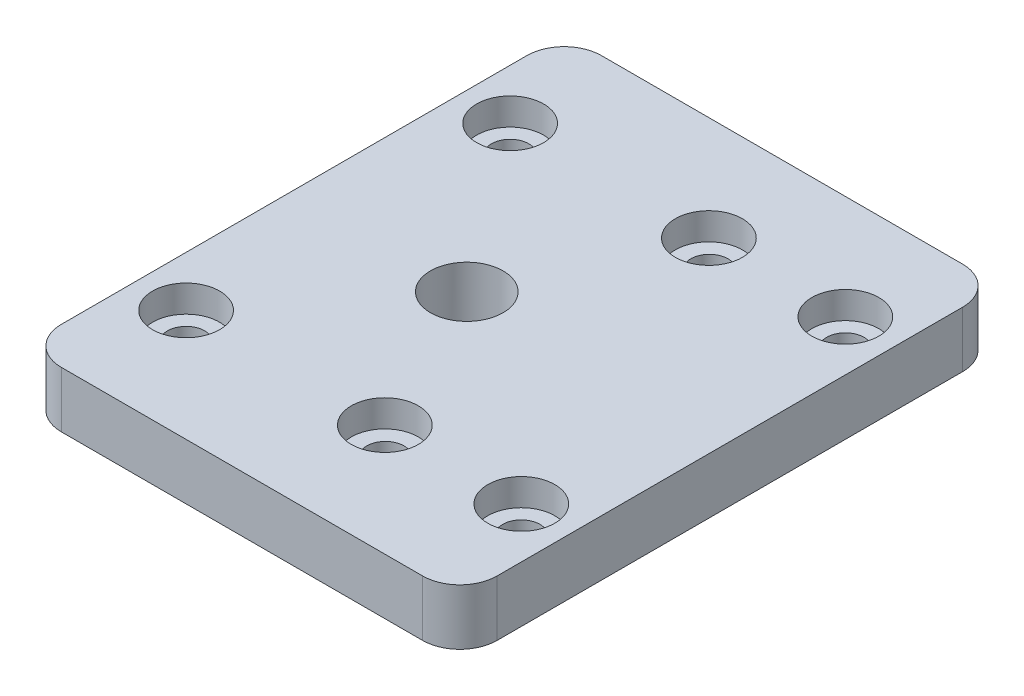
ISO-10303-21;
HEADER;
FILE_DESCRIPTION(('STEP AP214'),'2;1');
FILE_NAME('part.step','',(''),(''),'','','');
FILE_SCHEMA(('AUTOMOTIVE_DESIGN { 1 0 10303 214 1 1 1 1 }'));
ENDSEC;
DATA;
#1=APPLICATION_CONTEXT('core data for automotive mechanical design processes');
#2=APPLICATION_PROTOCOL_DEFINITION('international standard','automotive_design',2000,#1);
#3=PRODUCT_CONTEXT('',#1,'mechanical');
#4=PRODUCT('Part','Part','',(#3));
#5=PRODUCT_RELATED_PRODUCT_CATEGORY('part','',(#4));
#6=PRODUCT_DEFINITION_FORMATION('','',#4);
#7=PRODUCT_DEFINITION_CONTEXT('part definition',#1,'design');
#8=PRODUCT_DEFINITION('design','',#6,#7);
#9=PRODUCT_DEFINITION_SHAPE('','',#8);
#10=(LENGTH_UNIT() NAMED_UNIT(*) SI_UNIT(.MILLI.,.METRE.));
#11=(NAMED_UNIT(*) PLANE_ANGLE_UNIT() SI_UNIT($,.RADIAN.));
#12=(NAMED_UNIT(*) SI_UNIT($,.STERADIAN.) SOLID_ANGLE_UNIT());
#13=UNCERTAINTY_MEASURE_WITH_UNIT(LENGTH_MEASURE(1.E-05),#10,'distance_accuracy_value','');
#14=(GEOMETRIC_REPRESENTATION_CONTEXT(3) GLOBAL_UNCERTAINTY_ASSIGNED_CONTEXT((#13)) GLOBAL_UNIT_ASSIGNED_CONTEXT((#10,
#11,#12)) REPRESENTATION_CONTEXT('',''));
#15=CARTESIAN_POINT('',(0.,0.,0.));
#16=DIRECTION('',(0.,0.,1.));
#17=DIRECTION('',(1.,0.,0.));
#18=AXIS2_PLACEMENT_3D('',#15,#16,#17);
#19=CARTESIAN_POINT('',(-9.,-7.,-8.9));
#20=DIRECTION('',(0.,1.,0.));
#21=DIRECTION('',(0.,0.,1.));
#22=AXIS2_PLACEMENT_3D('',#19,#20,#21);
#23=CYLINDRICAL_SURFACE('',#22,1.);
#24=CARTESIAN_POINT('',(-9.,0.,-8.9));
#25=DIRECTION('',(0.,-1.,0.));
#26=DIRECTION('',(0.,0.,-1.));
#27=AXIS2_PLACEMENT_3D('',#24,#25,#26);
#28=CIRCLE('',#27,1.);
#29=CARTESIAN_POINT('',(-9.,0.,-9.9));
#30=VERTEX_POINT('',#29);
#31=EDGE_CURVE('E169',#30,#30,#28,.T.);
#32=ORIENTED_EDGE('',*,*,#31,.T.);
#33=EDGE_LOOP('',(#32));
#34=FACE_BOUND('',#33,.T.);
#35=CARTESIAN_POINT('',(-9.,1.55,-8.9));
#36=DIRECTION('',(0.,1.,0.));
#37=DIRECTION('',(0.,0.,1.));
#38=AXIS2_PLACEMENT_3D('',#35,#36,#37);
#39=CIRCLE('',#38,1.);
#40=CARTESIAN_POINT('',(-9.,1.55,-7.9));
#41=VERTEX_POINT('',#40);
#42=EDGE_CURVE('E40',#41,#41,#39,.F.);
#43=ORIENTED_EDGE('',*,*,#42,.F.);
#44=EDGE_LOOP('',(#43));
#45=FACE_BOUND('',#44,.T.);
#46=ADVANCED_FACE('F36',(#34,#45),#23,.F.);
#47=CARTESIAN_POINT('',(1.7,-7.,-8.9));
#48=DIRECTION('',(0.,1.,0.));
#49=DIRECTION('',(0.,0.,1.));
#50=AXIS2_PLACEMENT_3D('',#47,#48,#49);
#51=CYLINDRICAL_SURFACE('',#50,1.);
#52=CARTESIAN_POINT('',(1.7,0.,-8.9));
#53=DIRECTION('',(0.,-1.,0.));
#54=DIRECTION('',(0.,0.,-1.));
#55=AXIS2_PLACEMENT_3D('',#52,#53,#54);
#56=CIRCLE('',#55,1.);
#57=CARTESIAN_POINT('',(1.7,0.,-9.9));
#58=VERTEX_POINT('',#57);
#59=EDGE_CURVE('E165',#58,#58,#56,.T.);
#60=ORIENTED_EDGE('',*,*,#59,.T.);
#61=EDGE_LOOP('',(#60));
#62=FACE_BOUND('',#61,.T.);
#63=CARTESIAN_POINT('',(1.7,1.55,-8.9));
#64=DIRECTION('',(0.,1.,0.));
#65=DIRECTION('',(0.,0.,1.));
#66=AXIS2_PLACEMENT_3D('',#63,#64,#65);
#67=CIRCLE('',#66,1.);
#68=CARTESIAN_POINT('',(1.7,1.55,-7.9));
#69=VERTEX_POINT('',#68);
#70=EDGE_CURVE('E194',#69,#69,#67,.F.);
#71=ORIENTED_EDGE('',*,*,#70,.F.);
#72=EDGE_LOOP('',(#71));
#73=FACE_BOUND('',#72,.T.);
#74=ADVANCED_FACE('F273',(#62,#73),#51,.F.);
#75=CARTESIAN_POINT('',(9.,3.,-8.9));
#76=DIRECTION('',(0.,-1.,0.));
#77=DIRECTION('',(0.,0.,-1.));
#78=AXIS2_PLACEMENT_3D('',#75,#76,#77);
#79=CYLINDRICAL_SURFACE('',#78,1.);
#80=CARTESIAN_POINT('',(9.,0.,-8.9));
#81=DIRECTION('',(0.,1.,0.));
#82=DIRECTION('',(0.,0.,1.));
#83=AXIS2_PLACEMENT_3D('',#80,#81,#82);
#84=CIRCLE('',#83,1.);
#85=CARTESIAN_POINT('',(9.,0.,-7.9));
#86=VERTEX_POINT('',#85);
#87=EDGE_CURVE('E231',#86,#86,#84,.T.);
#88=ORIENTED_EDGE('',*,*,#87,.F.);
#89=EDGE_LOOP('',(#88));
#90=FACE_BOUND('',#89,.T.);
#91=CARTESIAN_POINT('',(9.,1.55,-8.9));
#92=DIRECTION('',(0.,1.,0.));
#93=DIRECTION('',(0.,0.,1.));
#94=AXIS2_PLACEMENT_3D('',#91,#92,#93);
#95=CIRCLE('',#94,1.);
#96=CARTESIAN_POINT('',(9.,1.55,-7.9));
#97=VERTEX_POINT('',#96);
#98=EDGE_CURVE('E190',#97,#97,#95,.T.);
#99=ORIENTED_EDGE('',*,*,#98,.T.);
#100=EDGE_LOOP('',(#99));
#101=FACE_BOUND('',#100,.T.);
#102=ADVANCED_FACE('F279',(#90,#101),#79,.F.);
#103=CARTESIAN_POINT('',(9.,3.,8.5));
#104=DIRECTION('',(0.,-1.,0.));
#105=DIRECTION('',(0.,0.,-1.));
#106=AXIS2_PLACEMENT_3D('',#103,#104,#105);
#107=CYLINDRICAL_SURFACE('',#106,1.);
#108=CARTESIAN_POINT('',(9.,0.,8.5));
#109=DIRECTION('',(0.,1.,0.));
#110=DIRECTION('',(0.,0.,-1.));
#111=AXIS2_PLACEMENT_3D('',#108,#109,#110);
#112=CIRCLE('',#111,1.);
#113=CARTESIAN_POINT('',(9.,0.,7.5));
#114=VERTEX_POINT('',#113);
#115=EDGE_CURVE('E137',#114,#114,#112,.T.);
#116=ORIENTED_EDGE('',*,*,#115,.F.);
#117=EDGE_LOOP('',(#116));
#118=FACE_BOUND('',#117,.T.);
#119=CARTESIAN_POINT('',(9.,1.55,8.5));
#120=DIRECTION('',(0.,1.,0.));
#121=DIRECTION('',(0.,0.,1.));
#122=AXIS2_PLACEMENT_3D('',#119,#120,#121);
#123=CIRCLE('',#122,1.);
#124=CARTESIAN_POINT('',(9.,1.55,9.5));
#125=VERTEX_POINT('',#124);
#126=EDGE_CURVE('E185',#125,#125,#123,.T.);
#127=ORIENTED_EDGE('',*,*,#126,.T.);
#128=EDGE_LOOP('',(#127));
#129=FACE_BOUND('',#128,.T.);
#130=ADVANCED_FACE('F289',(#118,#129),#107,.F.);
#131=CARTESIAN_POINT('',(1.7,3.,8.5));
#132=DIRECTION('',(0.,-1.,0.));
#133=DIRECTION('',(0.,0.,-1.));
#134=AXIS2_PLACEMENT_3D('',#131,#132,#133);
#135=CYLINDRICAL_SURFACE('',#134,1.);
#136=CARTESIAN_POINT('',(1.7,0.,8.5));
#137=DIRECTION('',(0.,1.,0.));
#138=DIRECTION('',(0.,0.,-1.));
#139=AXIS2_PLACEMENT_3D('',#136,#137,#138);
#140=CIRCLE('',#139,1.);
#141=CARTESIAN_POINT('',(1.7,0.,7.5));
#142=VERTEX_POINT('',#141);
#143=EDGE_CURVE('E168',#142,#142,#140,.T.);
#144=ORIENTED_EDGE('',*,*,#143,.F.);
#145=EDGE_LOOP('',(#144));
#146=FACE_BOUND('',#145,.T.);
#147=CARTESIAN_POINT('',(1.7,1.55,8.5));
#148=DIRECTION('',(0.,1.,0.));
#149=DIRECTION('',(0.,0.,1.));
#150=AXIS2_PLACEMENT_3D('',#147,#148,#149);
#151=CIRCLE('',#150,1.);
#152=CARTESIAN_POINT('',(1.7,1.55,9.5));
#153=VERTEX_POINT('',#152);
#154=EDGE_CURVE('E180',#153,#153,#151,.T.);
#155=ORIENTED_EDGE('',*,*,#154,.T.);
#156=EDGE_LOOP('',(#155));
#157=FACE_BOUND('',#156,.T.);
#158=ADVANCED_FACE('F285',(#146,#157),#135,.F.);
#159=CARTESIAN_POINT('',(-9.,3.,8.5));
#160=DIRECTION('',(0.,-1.,0.));
#161=DIRECTION('',(0.,0.,-1.));
#162=AXIS2_PLACEMENT_3D('',#159,#160,#161);
#163=CYLINDRICAL_SURFACE('',#162,1.);
#164=CARTESIAN_POINT('',(-9.,0.,8.5));
#165=DIRECTION('',(0.,1.,0.));
#166=DIRECTION('',(0.,0.,-1.));
#167=AXIS2_PLACEMENT_3D('',#164,#165,#166);
#168=CIRCLE('',#167,1.);
#169=CARTESIAN_POINT('',(-9.,0.,7.5));
#170=VERTEX_POINT('',#169);
#171=EDGE_CURVE('E234',#170,#170,#168,.T.);
#172=ORIENTED_EDGE('',*,*,#171,.F.);
#173=EDGE_LOOP('',(#172));
#174=FACE_BOUND('',#173,.T.);
#175=CARTESIAN_POINT('',(-9.,1.55,8.5));
#176=DIRECTION('',(0.,1.,0.));
#177=DIRECTION('',(0.,0.,1.));
#178=AXIS2_PLACEMENT_3D('',#175,#176,#177);
#179=CIRCLE('',#178,1.);
#180=CARTESIAN_POINT('',(-9.,1.55,9.5));
#181=VERTEX_POINT('',#180);
#182=EDGE_CURVE('E176',#181,#181,#179,.T.);
#183=ORIENTED_EDGE('',*,*,#182,.T.);
#184=EDGE_LOOP('',(#183));
#185=FACE_BOUND('',#184,.T.);
#186=ADVANCED_FACE('F288',(#174,#185),#163,.F.);
#187=CARTESIAN_POINT('',(0.,3.,0.));
#188=DIRECTION('',(0.,-1.,0.));
#189=DIRECTION('',(0.,0.,-1.));
#190=AXIS2_PLACEMENT_3D('',#187,#188,#189);
#191=PLANE('',#190);
#192=CARTESIAN_POINT('',(-9.,3.,-8.9));
#193=DIRECTION('',(0.,1.,0.));
#194=DIRECTION('',(0.,0.,1.));
#195=AXIS2_PLACEMENT_3D('',#192,#193,#194);
#196=CIRCLE('',#195,1.8);
#197=CARTESIAN_POINT('',(-9.,3.,-7.1));
#198=VERTEX_POINT('',#197);
#199=EDGE_CURVE('E210',#198,#198,#196,.T.);
#200=ORIENTED_EDGE('',*,*,#199,.F.);
#201=EDGE_LOOP('',(#200));
#202=FACE_BOUND('',#201,.T.);
#203=CARTESIAN_POINT('',(1.67182258338477,3.,-8.89999999999191));
#204=DIRECTION('',(0.,1.,0.));
#205=DIRECTION('',(0.,0.,1.));
#206=AXIS2_PLACEMENT_3D('',#203,#204,#205);
#207=CIRCLE('',#206,1.80000000000306);
#208=CARTESIAN_POINT('',(1.67182258338477,3.,-7.09999999998885));
#209=VERTEX_POINT('',#208);
#210=EDGE_CURVE('E203',#209,#209,#207,.T.);
#211=ORIENTED_EDGE('',*,*,#210,.F.);
#212=EDGE_LOOP('',(#211));
#213=FACE_BOUND('',#212,.T.);
#214=CARTESIAN_POINT('',(9.,3.,-8.9));
#215=DIRECTION('',(0.,1.,0.));
#216=DIRECTION('',(0.,0.,1.));
#217=AXIS2_PLACEMENT_3D('',#214,#215,#216);
#218=CIRCLE('',#217,1.8);
#219=CARTESIAN_POINT('',(9.,3.,-7.1));
#220=VERTEX_POINT('',#219);
#221=EDGE_CURVE('E196',#220,#220,#218,.T.);
#222=ORIENTED_EDGE('',*,*,#221,.F.);
#223=EDGE_LOOP('',(#222));
#224=FACE_BOUND('',#223,.T.);
#225=CARTESIAN_POINT('',(9.,3.,8.5));
#226=DIRECTION('',(0.,1.,0.));
#227=DIRECTION('',(0.,0.,1.));
#228=AXIS2_PLACEMENT_3D('',#225,#226,#227);
#229=CIRCLE('',#228,1.8);
#230=CARTESIAN_POINT('',(9.,3.,10.3));
#231=VERTEX_POINT('',#230);
#232=EDGE_CURVE('E192',#231,#231,#229,.T.);
#233=ORIENTED_EDGE('',*,*,#232,.F.);
#234=EDGE_LOOP('',(#233));
#235=FACE_BOUND('',#234,.T.);
#236=CARTESIAN_POINT('',(1.67182258337933,3.,8.50000000000803));
#237=DIRECTION('',(0.,1.,0.));
#238=DIRECTION('',(0.,0.,1.));
#239=AXIS2_PLACEMENT_3D('',#236,#237,#238);
#240=CIRCLE('',#239,1.80000000000306);
#241=CARTESIAN_POINT('',(1.67182258337933,3.,10.3000000000111));
#242=VERTEX_POINT('',#241);
#243=EDGE_CURVE('E188',#242,#242,#240,.T.);
#244=ORIENTED_EDGE('',*,*,#243,.F.);
#245=EDGE_LOOP('',(#244));
#246=FACE_BOUND('',#245,.T.);
#247=CARTESIAN_POINT('',(-9.,3.,8.5));
#248=DIRECTION('',(0.,1.,0.));
#249=DIRECTION('',(0.,0.,1.));
#250=AXIS2_PLACEMENT_3D('',#247,#248,#249);
#251=CIRCLE('',#250,1.8);
#252=CARTESIAN_POINT('',(-9.,3.,10.3));
#253=VERTEX_POINT('',#252);
#254=EDGE_CURVE('E183',#253,#253,#251,.T.);
#255=ORIENTED_EDGE('',*,*,#254,.F.);
#256=EDGE_LOOP('',(#255));
#257=FACE_BOUND('',#256,.T.);
#258=CARTESIAN_POINT('',(-2.3281774166205,3.,0.100000000001835));
#259=DIRECTION('',(0.,1.,0.));
#260=DIRECTION('',(0.,0.,1.));
#261=AXIS2_PLACEMENT_3D('',#258,#259,#260);
#262=CIRCLE('',#261,1.95);
#263=CARTESIAN_POINT('',(-2.3281774166205,3.,2.05000000000184));
#264=VERTEX_POINT('',#263);
#265=EDGE_CURVE('E175',#264,#264,#262,.T.);
#266=ORIENTED_EDGE('',*,*,#265,.F.);
#267=EDGE_LOOP('',(#266));
#268=FACE_BOUND('',#267,.T.);
#269=DIRECTION('',(0.,0.,-1.));
#270=VECTOR('',#269,1.);
#271=CARTESIAN_POINT('',(11.7,3.,14.5));
#272=LINE('',#271,#270);
#273=CARTESIAN_POINT('',(11.7,3.,12.5));
#274=VERTEX_POINT('',#273);
#275=CARTESIAN_POINT('',(11.7,3.,-12.5));
#276=VERTEX_POINT('',#275);
#277=EDGE_CURVE('E142',#274,#276,#272,.T.);
#278=ORIENTED_EDGE('',*,*,#277,.T.);
#279=CARTESIAN_POINT('',(9.69999999999999,3.,-12.5));
#280=DIRECTION('',(0.,-1.,0.));
#281=DIRECTION('',(0.,0.,-1.));
#282=AXIS2_PLACEMENT_3D('',#279,#280,#281);
#283=CIRCLE('',#282,2.);
#284=CARTESIAN_POINT('',(9.69999999999999,3.,-14.5));
#285=VERTEX_POINT('',#284);
#286=EDGE_CURVE('E157',#276,#285,#283,.F.);
#287=ORIENTED_EDGE('',*,*,#286,.T.);
#288=DIRECTION('',(-1.,0.,0.));
#289=VECTOR('',#288,1.);
#290=CARTESIAN_POINT('',(-11.7,3.,-14.5));
#291=LINE('',#290,#289);
#292=CARTESIAN_POINT('',(-9.7,3.,-14.5));
#293=VERTEX_POINT('',#292);
#294=EDGE_CURVE('E124',#285,#293,#291,.T.);
#295=ORIENTED_EDGE('',*,*,#294,.T.);
#296=CARTESIAN_POINT('',(-9.7,3.,-12.5));
#297=DIRECTION('',(0.,-1.,0.));
#298=DIRECTION('',(0.,0.,-1.));
#299=AXIS2_PLACEMENT_3D('',#296,#297,#298);
#300=CIRCLE('',#299,2.);
#301=CARTESIAN_POINT('',(-11.7,3.,-12.5));
#302=VERTEX_POINT('',#301);
#303=EDGE_CURVE('E152',#293,#302,#300,.F.);
#304=ORIENTED_EDGE('',*,*,#303,.T.);
#305=DIRECTION('',(0.,0.,1.));
#306=VECTOR('',#305,1.);
#307=CARTESIAN_POINT('',(-11.7,3.,14.5));
#308=LINE('',#307,#306);
#309=CARTESIAN_POINT('',(-11.7,3.,12.5));
#310=VERTEX_POINT('',#309);
#311=EDGE_CURVE('E242',#302,#310,#308,.T.);
#312=ORIENTED_EDGE('',*,*,#311,.T.);
#313=CARTESIAN_POINT('',(-9.7,3.,12.5));
#314=DIRECTION('',(0.,-1.,0.));
#315=DIRECTION('',(0.,0.,-1.));
#316=AXIS2_PLACEMENT_3D('',#313,#314,#315);
#317=CIRCLE('',#316,2.);
#318=CARTESIAN_POINT('',(-9.7,3.,14.5));
#319=VERTEX_POINT('',#318);
#320=EDGE_CURVE('E60',#310,#319,#317,.F.);
#321=ORIENTED_EDGE('',*,*,#320,.T.);
#322=DIRECTION('',(1.,0.,0.));
#323=VECTOR('',#322,1.);
#324=CARTESIAN_POINT('',(-11.7,3.,14.5));
#325=LINE('',#324,#323);
#326=CARTESIAN_POINT('',(9.69999999999999,3.,14.5));
#327=VERTEX_POINT('',#326);
#328=EDGE_CURVE('E143',#319,#327,#325,.T.);
#329=ORIENTED_EDGE('',*,*,#328,.T.);
#330=CARTESIAN_POINT('',(9.7,3.,12.5));
#331=DIRECTION('',(0.,-1.,0.));
#332=DIRECTION('',(0.,0.,-1.));
#333=AXIS2_PLACEMENT_3D('',#330,#331,#332);
#334=CIRCLE('',#333,2.);
#335=EDGE_CURVE('E155',#327,#274,#334,.F.);
#336=ORIENTED_EDGE('',*,*,#335,.T.);
#337=EDGE_LOOP('',(#278,#287,#295,#304,#312,#321,#329,#336));
#338=FACE_BOUND('',#337,.T.);
#339=ADVANCED_FACE('F244',(#202,#213,#224,#235,#246,#257,#268,#338),#191,.F.);
#340=CARTESIAN_POINT('',(0.,0.,0.));
#341=DIRECTION('',(0.,-1.,0.));
#342=DIRECTION('',(0.,0.,-1.));
#343=AXIS2_PLACEMENT_3D('',#340,#341,#342);
#344=PLANE('',#343);
#345=CARTESIAN_POINT('',(-2.3281774166205,0.,0.100000000001835));
#346=DIRECTION('',(0.,-1.,0.));
#347=DIRECTION('',(0.,0.,-1.));
#348=AXIS2_PLACEMENT_3D('',#345,#346,#347);
#349=CIRCLE('',#348,1.95);
#350=CARTESIAN_POINT('',(-2.3281774166205,0.,-1.84999999999817));
#351=VERTEX_POINT('',#350);
#352=EDGE_CURVE('E172',#351,#351,#349,.T.);
#353=ORIENTED_EDGE('',*,*,#352,.F.);
#354=EDGE_LOOP('',(#353));
#355=FACE_BOUND('',#354,.T.);
#356=ORIENTED_EDGE('',*,*,#31,.F.);
#357=EDGE_LOOP('',(#356));
#358=FACE_BOUND('',#357,.T.);
#359=ORIENTED_EDGE('',*,*,#59,.F.);
#360=EDGE_LOOP('',(#359));
#361=FACE_BOUND('',#360,.T.);
#362=ORIENTED_EDGE('',*,*,#87,.T.);
#363=EDGE_LOOP('',(#362));
#364=FACE_BOUND('',#363,.T.);
#365=ORIENTED_EDGE('',*,*,#115,.T.);
#366=EDGE_LOOP('',(#365));
#367=FACE_BOUND('',#366,.T.);
#368=DIRECTION('',(-1.,0.,0.));
#369=VECTOR('',#368,1.);
#370=CARTESIAN_POINT('',(-11.7,0.,-14.5));
#371=LINE('',#370,#369);
#372=CARTESIAN_POINT('',(9.69999999999999,0.,-14.5));
#373=VERTEX_POINT('',#372);
#374=CARTESIAN_POINT('',(-9.7,0.,-14.5));
#375=VERTEX_POINT('',#374);
#376=EDGE_CURVE('E121',#373,#375,#371,.T.);
#377=ORIENTED_EDGE('',*,*,#376,.F.);
#378=CARTESIAN_POINT('',(9.69999999999999,0.,-12.5));
#379=DIRECTION('',(0.,-1.,0.));
#380=DIRECTION('',(0.,0.,-1.));
#381=AXIS2_PLACEMENT_3D('',#378,#379,#380);
#382=CIRCLE('',#381,2.);
#383=CARTESIAN_POINT('',(11.7,0.,-12.5));
#384=VERTEX_POINT('',#383);
#385=EDGE_CURVE('E104',#373,#384,#382,.T.);
#386=ORIENTED_EDGE('',*,*,#385,.T.);
#387=DIRECTION('',(0.,0.,-1.));
#388=VECTOR('',#387,1.);
#389=CARTESIAN_POINT('',(11.7,0.,14.5));
#390=LINE('',#389,#388);
#391=CARTESIAN_POINT('',(11.7,0.,12.5));
#392=VERTEX_POINT('',#391);
#393=EDGE_CURVE('E132',#392,#384,#390,.T.);
#394=ORIENTED_EDGE('',*,*,#393,.F.);
#395=CARTESIAN_POINT('',(9.7,0.,12.5));
#396=DIRECTION('',(0.,-1.,0.));
#397=DIRECTION('',(0.,0.,-1.));
#398=AXIS2_PLACEMENT_3D('',#395,#396,#397);
#399=CIRCLE('',#398,2.);
#400=CARTESIAN_POINT('',(9.69999999999999,0.,14.5));
#401=VERTEX_POINT('',#400);
#402=EDGE_CURVE('E115',#392,#401,#399,.T.);
#403=ORIENTED_EDGE('',*,*,#402,.T.);
#404=DIRECTION('',(1.,0.,0.));
#405=VECTOR('',#404,1.);
#406=CARTESIAN_POINT('',(-11.7,0.,14.5));
#407=LINE('',#406,#405);
#408=CARTESIAN_POINT('',(-9.7,0.,14.5));
#409=VERTEX_POINT('',#408);
#410=EDGE_CURVE('E135',#409,#401,#407,.T.);
#411=ORIENTED_EDGE('',*,*,#410,.F.);
#412=CARTESIAN_POINT('',(-9.7,0.,12.5));
#413=DIRECTION('',(0.,-1.,0.));
#414=DIRECTION('',(0.,0.,-1.));
#415=AXIS2_PLACEMENT_3D('',#412,#413,#414);
#416=CIRCLE('',#415,2.);
#417=CARTESIAN_POINT('',(-11.7,0.,12.5));
#418=VERTEX_POINT('',#417);
#419=EDGE_CURVE('E146',#409,#418,#416,.T.);
#420=ORIENTED_EDGE('',*,*,#419,.T.);
#421=DIRECTION('',(0.,0.,1.));
#422=VECTOR('',#421,1.);
#423=CARTESIAN_POINT('',(-11.7,0.,14.5));
#424=LINE('',#423,#422);
#425=CARTESIAN_POINT('',(-11.7,0.,-12.5));
#426=VERTEX_POINT('',#425);
#427=EDGE_CURVE('E131',#426,#418,#424,.T.);
#428=ORIENTED_EDGE('',*,*,#427,.F.);
#429=CARTESIAN_POINT('',(-9.7,0.,-12.5));
#430=DIRECTION('',(0.,-1.,0.));
#431=DIRECTION('',(0.,0.,-1.));
#432=AXIS2_PLACEMENT_3D('',#429,#430,#431);
#433=CIRCLE('',#432,2.);
#434=EDGE_CURVE('E125',#426,#375,#433,.T.);
#435=ORIENTED_EDGE('',*,*,#434,.T.);
#436=EDGE_LOOP('',(#377,#386,#394,#403,#411,#420,#428,#435));
#437=FACE_BOUND('',#436,.T.);
#438=ORIENTED_EDGE('',*,*,#171,.T.);
#439=EDGE_LOOP('',(#438));
#440=FACE_BOUND('',#439,.T.);
#441=ORIENTED_EDGE('',*,*,#143,.T.);
#442=EDGE_LOOP('',(#441));
#443=FACE_BOUND('',#442,.T.);
#444=ADVANCED_FACE('F128',(#355,#358,#361,#364,#367,#437,#440,#443),#344,.T.);
#445=CARTESIAN_POINT('',(11.7,3.,14.5));
#446=DIRECTION('',(-1.,0.,0.));
#447=DIRECTION('',(0.,0.,1.));
#448=AXIS2_PLACEMENT_3D('',#445,#446,#447);
#449=PLANE('',#448);
#450=ORIENTED_EDGE('',*,*,#393,.T.);
#451=DIRECTION('',(0.,-1.,0.));
#452=VECTOR('',#451,1.);
#453=CARTESIAN_POINT('',(11.7,3.,-12.5));
#454=LINE('',#453,#452);
#455=EDGE_CURVE('E109',#384,#276,#454,.F.);
#456=ORIENTED_EDGE('',*,*,#455,.T.);
#457=ORIENTED_EDGE('',*,*,#277,.F.);
#458=DIRECTION('',(0.,-1.,0.));
#459=VECTOR('',#458,1.);
#460=CARTESIAN_POINT('',(11.7,3.,12.5));
#461=LINE('',#460,#459);
#462=EDGE_CURVE('E114',#274,#392,#461,.T.);
#463=ORIENTED_EDGE('',*,*,#462,.T.);
#464=EDGE_LOOP('',(#450,#456,#457,#463));
#465=FACE_BOUND('',#464,.T.);
#466=ADVANCED_FACE('F251',(#465),#449,.F.);
#467=CARTESIAN_POINT('',(-11.7,3.,-14.5));
#468=DIRECTION('',(0.,0.,1.));
#469=DIRECTION('',(1.,0.,0.));
#470=AXIS2_PLACEMENT_3D('',#467,#468,#469);
#471=PLANE('',#470);
#472=ORIENTED_EDGE('',*,*,#294,.F.);
#473=DIRECTION('',(0.,-1.,0.));
#474=VECTOR('',#473,1.);
#475=CARTESIAN_POINT('',(9.69999999999999,3.,-14.5));
#476=LINE('',#475,#474);
#477=EDGE_CURVE('E108',#285,#373,#476,.T.);
#478=ORIENTED_EDGE('',*,*,#477,.T.);
#479=ORIENTED_EDGE('',*,*,#376,.T.);
#480=DIRECTION('',(0.,-1.,0.));
#481=VECTOR('',#480,1.);
#482=CARTESIAN_POINT('',(-9.7,3.,-14.5));
#483=LINE('',#482,#481);
#484=EDGE_CURVE('E126',#375,#293,#483,.F.);
#485=ORIENTED_EDGE('',*,*,#484,.T.);
#486=EDGE_LOOP('',(#472,#478,#479,#485));
#487=FACE_BOUND('',#486,.T.);
#488=ADVANCED_FACE('F120',(#487),#471,.F.);
#489=CARTESIAN_POINT('',(-11.7,3.,14.5));
#490=DIRECTION('',(1.,0.,0.));
#491=DIRECTION('',(0.,0.,-1.));
#492=AXIS2_PLACEMENT_3D('',#489,#490,#491);
#493=PLANE('',#492);
#494=ORIENTED_EDGE('',*,*,#427,.T.);
#495=DIRECTION('',(0.,-1.,0.));
#496=VECTOR('',#495,1.);
#497=CARTESIAN_POINT('',(-11.7,3.,12.5));
#498=LINE('',#497,#496);
#499=EDGE_CURVE('E11',#418,#310,#498,.F.);
#500=ORIENTED_EDGE('',*,*,#499,.T.);
#501=ORIENTED_EDGE('',*,*,#311,.F.);
#502=DIRECTION('',(0.,-1.,0.));
#503=VECTOR('',#502,1.);
#504=CARTESIAN_POINT('',(-11.7,3.,-12.5));
#505=LINE('',#504,#503);
#506=EDGE_CURVE('E45',#302,#426,#505,.T.);
#507=ORIENTED_EDGE('',*,*,#506,.T.);
#508=EDGE_LOOP('',(#494,#500,#501,#507));
#509=FACE_BOUND('',#508,.T.);
#510=ADVANCED_FACE('F258',(#509),#493,.F.);
#511=CARTESIAN_POINT('',(-11.7,3.,14.5));
#512=DIRECTION('',(0.,0.,-1.));
#513=DIRECTION('',(-1.,0.,0.));
#514=AXIS2_PLACEMENT_3D('',#511,#512,#513);
#515=PLANE('',#514);
#516=ORIENTED_EDGE('',*,*,#410,.T.);
#517=DIRECTION('',(0.,-1.,0.));
#518=VECTOR('',#517,1.);
#519=CARTESIAN_POINT('',(9.69999999999999,3.,14.5));
#520=LINE('',#519,#518);
#521=EDGE_CURVE('E53',#401,#327,#520,.F.);
#522=ORIENTED_EDGE('',*,*,#521,.T.);
#523=ORIENTED_EDGE('',*,*,#328,.F.);
#524=DIRECTION('',(0.,-1.,0.));
#525=VECTOR('',#524,1.);
#526=CARTESIAN_POINT('',(-9.7,3.,14.5));
#527=LINE('',#526,#525);
#528=EDGE_CURVE('E159',#319,#409,#527,.T.);
#529=ORIENTED_EDGE('',*,*,#528,.T.);
#530=EDGE_LOOP('',(#516,#522,#523,#529));
#531=FACE_BOUND('',#530,.T.);
#532=ADVANCED_FACE('F253',(#531),#515,.F.);
#533=CARTESIAN_POINT('',(9.69999999999999,3.,-12.5));
#534=DIRECTION('',(0.,-1.,0.));
#535=DIRECTION('',(0.,0.,-1.));
#536=AXIS2_PLACEMENT_3D('',#533,#534,#535);
#537=CYLINDRICAL_SURFACE('',#536,2.);
#538=ORIENTED_EDGE('',*,*,#286,.F.);
#539=ORIENTED_EDGE('',*,*,#455,.F.);
#540=ORIENTED_EDGE('',*,*,#385,.F.);
#541=ORIENTED_EDGE('',*,*,#477,.F.);
#542=EDGE_LOOP('',(#538,#539,#540,#541));
#543=FACE_BOUND('',#542,.T.);
#544=ADVANCED_FACE('F107',(#543),#537,.T.);
#545=CARTESIAN_POINT('',(9.7,3.,12.5));
#546=DIRECTION('',(0.,-1.,0.));
#547=DIRECTION('',(0.,0.,-1.));
#548=AXIS2_PLACEMENT_3D('',#545,#546,#547);
#549=CYLINDRICAL_SURFACE('',#548,2.);
#550=ORIENTED_EDGE('',*,*,#335,.F.);
#551=ORIENTED_EDGE('',*,*,#521,.F.);
#552=ORIENTED_EDGE('',*,*,#402,.F.);
#553=ORIENTED_EDGE('',*,*,#462,.F.);
#554=EDGE_LOOP('',(#550,#551,#552,#553));
#555=FACE_BOUND('',#554,.T.);
#556=ADVANCED_FACE('F249',(#555),#549,.T.);
#557=CARTESIAN_POINT('',(-9.7,3.,12.5));
#558=DIRECTION('',(0.,-1.,0.));
#559=DIRECTION('',(0.,0.,-1.));
#560=AXIS2_PLACEMENT_3D('',#557,#558,#559);
#561=CYLINDRICAL_SURFACE('',#560,2.);
#562=ORIENTED_EDGE('',*,*,#320,.F.);
#563=ORIENTED_EDGE('',*,*,#499,.F.);
#564=ORIENTED_EDGE('',*,*,#419,.F.);
#565=ORIENTED_EDGE('',*,*,#528,.F.);
#566=EDGE_LOOP('',(#562,#563,#564,#565));
#567=FACE_BOUND('',#566,.T.);
#568=ADVANCED_FACE('F255',(#567),#561,.T.);
#569=CARTESIAN_POINT('',(-9.7,3.,-12.5));
#570=DIRECTION('',(0.,-1.,0.));
#571=DIRECTION('',(0.,0.,-1.));
#572=AXIS2_PLACEMENT_3D('',#569,#570,#571);
#573=CYLINDRICAL_SURFACE('',#572,2.);
#574=ORIENTED_EDGE('',*,*,#303,.F.);
#575=ORIENTED_EDGE('',*,*,#484,.F.);
#576=ORIENTED_EDGE('',*,*,#434,.F.);
#577=ORIENTED_EDGE('',*,*,#506,.F.);
#578=EDGE_LOOP('',(#574,#575,#576,#577));
#579=FACE_BOUND('',#578,.T.);
#580=ADVANCED_FACE('F38',(#579),#573,.T.);
#581=CARTESIAN_POINT('',(-2.3281774166205,-7.,0.100000000001835));
#582=DIRECTION('',(0.,1.,0.));
#583=DIRECTION('',(0.,0.,1.));
#584=AXIS2_PLACEMENT_3D('',#581,#582,#583);
#585=CYLINDRICAL_SURFACE('',#584,1.95);
#586=ORIENTED_EDGE('',*,*,#352,.T.);
#587=EDGE_LOOP('',(#586));
#588=FACE_BOUND('',#587,.T.);
#589=ORIENTED_EDGE('',*,*,#265,.T.);
#590=EDGE_LOOP('',(#589));
#591=FACE_BOUND('',#590,.T.);
#592=ADVANCED_FACE('F264',(#588,#591),#585,.F.);
#593=CARTESIAN_POINT('',(-9.,1.55,8.5));
#594=DIRECTION('',(0.,1.,0.));
#595=DIRECTION('',(0.,0.,1.));
#596=AXIS2_PLACEMENT_3D('',#593,#594,#595);
#597=CYLINDRICAL_SURFACE('',#596,1.8);
#598=CARTESIAN_POINT('',(-9.,1.55,8.5));
#599=DIRECTION('',(0.,1.,0.));
#600=DIRECTION('',(0.,0.,1.));
#601=AXIS2_PLACEMENT_3D('',#598,#599,#600);
#602=CIRCLE('',#601,1.8);
#603=CARTESIAN_POINT('',(-9.,1.55,10.3));
#604=VERTEX_POINT('',#603);
#605=EDGE_CURVE('E179',#604,#604,#602,.T.);
#606=ORIENTED_EDGE('',*,*,#605,.F.);
#607=EDGE_LOOP('',(#606));
#608=FACE_BOUND('',#607,.T.);
#609=ORIENTED_EDGE('',*,*,#254,.T.);
#610=EDGE_LOOP('',(#609));
#611=FACE_BOUND('',#610,.T.);
#612=ADVANCED_FACE('F269',(#608,#611),#597,.F.);
#613=CARTESIAN_POINT('',(-9.,1.55,8.5));
#614=DIRECTION('',(0.,1.,0.));
#615=DIRECTION('',(0.,0.,1.));
#616=AXIS2_PLACEMENT_3D('',#613,#614,#615);
#617=PLANE('',#616);
#618=ORIENTED_EDGE('',*,*,#182,.F.);
#619=EDGE_LOOP('',(#618));
#620=FACE_BOUND('',#619,.T.);
#621=ORIENTED_EDGE('',*,*,#605,.T.);
#622=EDGE_LOOP('',(#621));
#623=FACE_BOUND('',#622,.T.);
#624=ADVANCED_FACE('F392',(#620,#623),#617,.T.);
#625=CARTESIAN_POINT('',(1.67182258337933,1.55,8.50000000000803));
#626=DIRECTION('',(0.,1.,0.));
#627=DIRECTION('',(0.,0.,1.));
#628=AXIS2_PLACEMENT_3D('',#625,#626,#627);
#629=CYLINDRICAL_SURFACE('',#628,1.80000000000306);
#630=CARTESIAN_POINT('',(1.67182258337933,1.55,8.50000000000803));
#631=DIRECTION('',(0.,1.,0.));
#632=DIRECTION('',(0.,0.,1.));
#633=AXIS2_PLACEMENT_3D('',#630,#631,#632);
#634=CIRCLE('',#633,1.80000000000306);
#635=CARTESIAN_POINT('',(1.67182258337933,1.55,10.3000000000111));
#636=VERTEX_POINT('',#635);
#637=EDGE_CURVE('E184',#636,#636,#634,.T.);
#638=ORIENTED_EDGE('',*,*,#637,.F.);
#639=EDGE_LOOP('',(#638));
#640=FACE_BOUND('',#639,.T.);
#641=ORIENTED_EDGE('',*,*,#243,.T.);
#642=EDGE_LOOP('',(#641));
#643=FACE_BOUND('',#642,.T.);
#644=ADVANCED_FACE('F401',(#640,#643),#629,.F.);
#645=CARTESIAN_POINT('',(1.67182258337933,1.55,8.50000000000803));
#646=DIRECTION('',(0.,1.,0.));
#647=DIRECTION('',(0.,0.,1.));
#648=AXIS2_PLACEMENT_3D('',#645,#646,#647);
#649=PLANE('',#648);
#650=ORIENTED_EDGE('',*,*,#154,.F.);
#651=EDGE_LOOP('',(#650));
#652=FACE_BOUND('',#651,.T.);
#653=ORIENTED_EDGE('',*,*,#637,.T.);
#654=EDGE_LOOP('',(#653));
#655=FACE_BOUND('',#654,.T.);
#656=ADVANCED_FACE('F411',(#652,#655),#649,.T.);
#657=CARTESIAN_POINT('',(9.,1.55,8.5));
#658=DIRECTION('',(0.,1.,0.));
#659=DIRECTION('',(0.,0.,1.));
#660=AXIS2_PLACEMENT_3D('',#657,#658,#659);
#661=CYLINDRICAL_SURFACE('',#660,1.8);
#662=CARTESIAN_POINT('',(9.,1.55,8.5));
#663=DIRECTION('',(0.,1.,0.));
#664=DIRECTION('',(0.,0.,1.));
#665=AXIS2_PLACEMENT_3D('',#662,#663,#664);
#666=CIRCLE('',#665,1.8);
#667=CARTESIAN_POINT('',(9.,1.55,10.3));
#668=VERTEX_POINT('',#667);
#669=EDGE_CURVE('E189',#668,#668,#666,.T.);
#670=ORIENTED_EDGE('',*,*,#669,.F.);
#671=EDGE_LOOP('',(#670));
#672=FACE_BOUND('',#671,.T.);
#673=ORIENTED_EDGE('',*,*,#232,.T.);
#674=EDGE_LOOP('',(#673));
#675=FACE_BOUND('',#674,.T.);
#676=ADVANCED_FACE('F421',(#672,#675),#661,.F.);
#677=CARTESIAN_POINT('',(9.,1.55,8.5));
#678=DIRECTION('',(0.,1.,0.));
#679=DIRECTION('',(0.,0.,1.));
#680=AXIS2_PLACEMENT_3D('',#677,#678,#679);
#681=PLANE('',#680);
#682=ORIENTED_EDGE('',*,*,#126,.F.);
#683=EDGE_LOOP('',(#682));
#684=FACE_BOUND('',#683,.T.);
#685=ORIENTED_EDGE('',*,*,#669,.T.);
#686=EDGE_LOOP('',(#685));
#687=FACE_BOUND('',#686,.T.);
#688=ADVANCED_FACE('F431',(#684,#687),#681,.T.);
#689=CARTESIAN_POINT('',(9.,1.55,-8.9));
#690=DIRECTION('',(0.,1.,0.));
#691=DIRECTION('',(0.,0.,1.));
#692=AXIS2_PLACEMENT_3D('',#689,#690,#691);
#693=CYLINDRICAL_SURFACE('',#692,1.8);
#694=CARTESIAN_POINT('',(9.,1.55,-8.9));
#695=DIRECTION('',(0.,1.,0.));
#696=DIRECTION('',(0.,0.,1.));
#697=AXIS2_PLACEMENT_3D('',#694,#695,#696);
#698=CIRCLE('',#697,1.8);
#699=CARTESIAN_POINT('',(9.,1.55,-7.1));
#700=VERTEX_POINT('',#699);
#701=EDGE_CURVE('E193',#700,#700,#698,.T.);
#702=ORIENTED_EDGE('',*,*,#701,.F.);
#703=EDGE_LOOP('',(#702));
#704=FACE_BOUND('',#703,.T.);
#705=ORIENTED_EDGE('',*,*,#221,.T.);
#706=EDGE_LOOP('',(#705));
#707=FACE_BOUND('',#706,.T.);
#708=ADVANCED_FACE('F441',(#704,#707),#693,.F.);
#709=CARTESIAN_POINT('',(9.,1.55,-8.9));
#710=DIRECTION('',(0.,1.,0.));
#711=DIRECTION('',(0.,0.,1.));
#712=AXIS2_PLACEMENT_3D('',#709,#710,#711);
#713=PLANE('',#712);
#714=ORIENTED_EDGE('',*,*,#98,.F.);
#715=EDGE_LOOP('',(#714));
#716=FACE_BOUND('',#715,.T.);
#717=ORIENTED_EDGE('',*,*,#701,.T.);
#718=EDGE_LOOP('',(#717));
#719=FACE_BOUND('',#718,.T.);
#720=ADVANCED_FACE('F451',(#716,#719),#713,.T.);
#721=CARTESIAN_POINT('',(1.67182258338477,1.55,-8.89999999999191));
#722=DIRECTION('',(0.,1.,0.));
#723=DIRECTION('',(0.,0.,1.));
#724=AXIS2_PLACEMENT_3D('',#721,#722,#723);
#725=PLANE('',#724);
#726=CARTESIAN_POINT('',(1.67182258338477,1.55,-8.89999999999191));
#727=DIRECTION('',(0.,1.,0.));
#728=DIRECTION('',(0.,0.,1.));
#729=AXIS2_PLACEMENT_3D('',#726,#727,#728);
#730=CIRCLE('',#729,1.80000000000306);
#731=CARTESIAN_POINT('',(1.67182258338477,1.55,-7.09999999998885));
#732=VERTEX_POINT('',#731);
#733=EDGE_CURVE('E197',#732,#732,#730,.T.);
#734=ORIENTED_EDGE('',*,*,#733,.T.);
#735=EDGE_LOOP('',(#734));
#736=FACE_BOUND('',#735,.T.);
#737=ORIENTED_EDGE('',*,*,#70,.T.);
#738=EDGE_LOOP('',(#737));
#739=FACE_BOUND('',#738,.T.);
#740=ADVANCED_FACE('F461',(#736,#739),#725,.T.);
#741=CARTESIAN_POINT('',(1.67182258338477,1.55,-8.89999999999191));
#742=DIRECTION('',(0.,1.,0.));
#743=DIRECTION('',(0.,0.,1.));
#744=AXIS2_PLACEMENT_3D('',#741,#742,#743);
#745=CYLINDRICAL_SURFACE('',#744,1.80000000000306);
#746=ORIENTED_EDGE('',*,*,#733,.F.);
#747=EDGE_LOOP('',(#746));
#748=FACE_BOUND('',#747,.T.);
#749=ORIENTED_EDGE('',*,*,#210,.T.);
#750=EDGE_LOOP('',(#749));
#751=FACE_BOUND('',#750,.T.);
#752=ADVANCED_FACE('F471',(#748,#751),#745,.F.);
#753=CARTESIAN_POINT('',(-9.,1.55,-8.9));
#754=DIRECTION('',(0.,1.,0.));
#755=DIRECTION('',(0.,0.,1.));
#756=AXIS2_PLACEMENT_3D('',#753,#754,#755);
#757=PLANE('',#756);
#758=CARTESIAN_POINT('',(-9.,1.55,-8.9));
#759=DIRECTION('',(0.,1.,0.));
#760=DIRECTION('',(0.,0.,1.));
#761=AXIS2_PLACEMENT_3D('',#758,#759,#760);
#762=CIRCLE('',#761,1.8);
#763=CARTESIAN_POINT('',(-9.,1.55,-7.1));
#764=VERTEX_POINT('',#763);
#765=EDGE_CURVE('E507',#764,#764,#762,.T.);
#766=ORIENTED_EDGE('',*,*,#765,.T.);
#767=EDGE_LOOP('',(#766));
#768=FACE_BOUND('',#767,.T.);
#769=ORIENTED_EDGE('',*,*,#42,.T.);
#770=EDGE_LOOP('',(#769));
#771=FACE_BOUND('',#770,.T.);
#772=ADVANCED_FACE('F480',(#768,#771),#757,.T.);
#773=CARTESIAN_POINT('',(-9.,1.55,-8.9));
#774=DIRECTION('',(0.,1.,0.));
#775=DIRECTION('',(0.,0.,1.));
#776=AXIS2_PLACEMENT_3D('',#773,#774,#775);
#777=CYLINDRICAL_SURFACE('',#776,1.8);
#778=ORIENTED_EDGE('',*,*,#765,.F.);
#779=EDGE_LOOP('',(#778));
#780=FACE_BOUND('',#779,.T.);
#781=ORIENTED_EDGE('',*,*,#199,.T.);
#782=EDGE_LOOP('',(#781));
#783=FACE_BOUND('',#782,.T.);
#784=ADVANCED_FACE('F490',(#780,#783),#777,.F.);
#785=CLOSED_SHELL('',(#46,#74,#102,#130,#158,#186,#339,#444,#466,#488,#510,#532,#544,#556,#568,
#580,#592,#612,#624,#644,#656,#676,#688,#708,#720,#740,#752,#772,#784));
#786=MANIFOLD_SOLID_BREP('B2',#785);
#787=ADVANCED_BREP_SHAPE_REPRESENTATION('',(#18,#786),#14);
#788=SHAPE_DEFINITION_REPRESENTATION(#9,#787);
ENDSEC;
END-ISO-10303-21;
